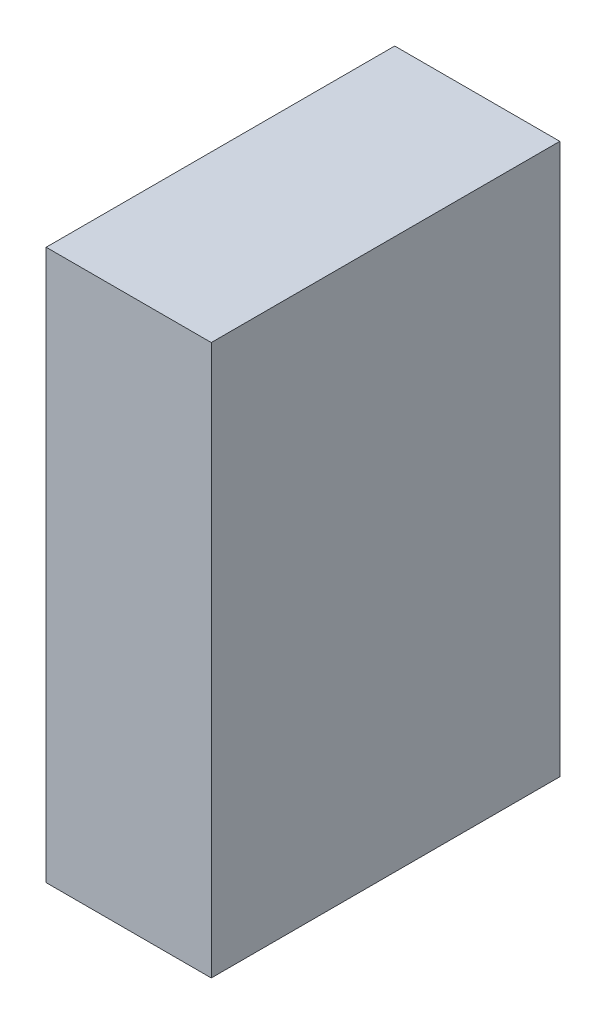
ISO-10303-21;
HEADER;
FILE_DESCRIPTION(('STEP AP214'),'2;1');
FILE_NAME('part.step','',(''),(''),'','','');
FILE_SCHEMA(('AUTOMOTIVE_DESIGN { 1 0 10303 214 1 1 1 1 }'));
ENDSEC;
DATA;
#1=APPLICATION_CONTEXT('core data for automotive mechanical design processes');
#2=APPLICATION_PROTOCOL_DEFINITION('international standard','automotive_design',2000,#1);
#3=PRODUCT_CONTEXT('',#1,'mechanical');
#4=PRODUCT('Part','Part','',(#3));
#5=PRODUCT_RELATED_PRODUCT_CATEGORY('part','',(#4));
#6=PRODUCT_DEFINITION_FORMATION('','',#4);
#7=PRODUCT_DEFINITION_CONTEXT('part definition',#1,'design');
#8=PRODUCT_DEFINITION('design','',#6,#7);
#9=PRODUCT_DEFINITION_SHAPE('','',#8);
#10=(LENGTH_UNIT() NAMED_UNIT(*) SI_UNIT(.MILLI.,.METRE.));
#11=(NAMED_UNIT(*) PLANE_ANGLE_UNIT() SI_UNIT($,.RADIAN.));
#12=(NAMED_UNIT(*) SI_UNIT($,.STERADIAN.) SOLID_ANGLE_UNIT());
#13=UNCERTAINTY_MEASURE_WITH_UNIT(LENGTH_MEASURE(1.E-05),#10,'distance_accuracy_value','');
#14=(GEOMETRIC_REPRESENTATION_CONTEXT(3) GLOBAL_UNCERTAINTY_ASSIGNED_CONTEXT((#13)) GLOBAL_UNIT_ASSIGNED_CONTEXT((#10,
#11,#12)) REPRESENTATION_CONTEXT('',''));
#15=CARTESIAN_POINT('',(0.,0.,0.));
#16=DIRECTION('',(0.,0.,1.));
#17=DIRECTION('',(1.,0.,0.));
#18=AXIS2_PLACEMENT_3D('',#15,#16,#17);
#19=CARTESIAN_POINT('',(-0.1143,0.381,0.));
#20=DIRECTION('',(1.,0.,0.));
#21=DIRECTION('',(0.,0.,-1.));
#22=AXIS2_PLACEMENT_3D('',#19,#20,#21);
#23=PLANE('',#22);
#24=DIRECTION('',(0.,0.,1.));
#25=VECTOR('',#24,1.);
#26=CARTESIAN_POINT('',(-0.1143,-0.381,0.));
#27=LINE('',#26,#25);
#28=CARTESIAN_POINT('',(-0.1143,-0.381,0.));
#29=VERTEX_POINT('',#28);
#30=CARTESIAN_POINT('',(-0.1143,-0.381,0.4826));
#31=VERTEX_POINT('',#30);
#32=EDGE_CURVE('E20',#29,#31,#27,.T.);
#33=ORIENTED_EDGE('',*,*,#32,.T.);
#34=DIRECTION('',(0.,1.,0.));
#35=VECTOR('',#34,1.);
#36=CARTESIAN_POINT('',(-0.1143,-0.381,0.4826));
#37=LINE('',#36,#35);
#38=CARTESIAN_POINT('',(-0.1143,0.381,0.4826));
#39=VERTEX_POINT('',#38);
#40=EDGE_CURVE('E55',#31,#39,#37,.T.);
#41=ORIENTED_EDGE('',*,*,#40,.T.);
#42=DIRECTION('',(0.,0.,-1.));
#43=VECTOR('',#42,1.);
#44=CARTESIAN_POINT('',(-0.1143,0.381,0.));
#45=LINE('',#44,#43);
#46=CARTESIAN_POINT('',(-0.1143,0.381,0.));
#47=VERTEX_POINT('',#46);
#48=EDGE_CURVE('E74',#39,#47,#45,.T.);
#49=ORIENTED_EDGE('',*,*,#48,.T.);
#50=DIRECTION('',(0.,1.,0.));
#51=VECTOR('',#50,1.);
#52=CARTESIAN_POINT('',(-0.1143,-0.381,0.));
#53=LINE('',#52,#51);
#54=EDGE_CURVE('E66',#29,#47,#53,.T.);
#55=ORIENTED_EDGE('',*,*,#54,.F.);
#56=EDGE_LOOP('',(#33,#41,#49,#55));
#57=FACE_BOUND('',#56,.T.);
#58=ADVANCED_FACE('F17',(#57),#23,.F.);
#59=CARTESIAN_POINT('',(-0.1143,-0.381,0.));
#60=DIRECTION('',(0.,1.,0.));
#61=DIRECTION('',(0.,0.,1.));
#62=AXIS2_PLACEMENT_3D('',#59,#60,#61);
#63=PLANE('',#62);
#64=DIRECTION('',(0.,0.,1.));
#65=VECTOR('',#64,1.);
#66=CARTESIAN_POINT('',(0.1143,-0.381,0.));
#67=LINE('',#66,#65);
#68=CARTESIAN_POINT('',(0.1143,-0.381,0.));
#69=VERTEX_POINT('',#68);
#70=CARTESIAN_POINT('',(0.1143,-0.381,0.4826));
#71=VERTEX_POINT('',#70);
#72=EDGE_CURVE('E72',#69,#71,#67,.T.);
#73=ORIENTED_EDGE('',*,*,#72,.T.);
#74=DIRECTION('',(-1.,0.,0.));
#75=VECTOR('',#74,1.);
#76=CARTESIAN_POINT('',(-0.1143,-0.381,0.4826));
#77=LINE('',#76,#75);
#78=EDGE_CURVE('E62',#71,#31,#77,.T.);
#79=ORIENTED_EDGE('',*,*,#78,.T.);
#80=ORIENTED_EDGE('',*,*,#32,.F.);
#81=DIRECTION('',(-1.,0.,0.));
#82=VECTOR('',#81,1.);
#83=CARTESIAN_POINT('',(-0.1143,-0.381,0.));
#84=LINE('',#83,#82);
#85=EDGE_CURVE('E80',#69,#29,#84,.T.);
#86=ORIENTED_EDGE('',*,*,#85,.F.);
#87=EDGE_LOOP('',(#73,#79,#80,#86));
#88=FACE_BOUND('',#87,.T.);
#89=ADVANCED_FACE('F71',(#88),#63,.F.);
#90=CARTESIAN_POINT('',(-0.1143,-0.381,0.4826));
#91=DIRECTION('',(0.,0.,-1.));
#92=DIRECTION('',(-1.,0.,0.));
#93=AXIS2_PLACEMENT_3D('',#90,#91,#92);
#94=PLANE('',#93);
#95=DIRECTION('',(0.,1.,0.));
#96=VECTOR('',#95,1.);
#97=CARTESIAN_POINT('',(0.1143,-0.381,0.4826));
#98=LINE('',#97,#96);
#99=CARTESIAN_POINT('',(0.1143,0.381,0.4826));
#100=VERTEX_POINT('',#99);
#101=EDGE_CURVE('E83',#71,#100,#98,.T.);
#102=ORIENTED_EDGE('',*,*,#101,.T.);
#103=DIRECTION('',(1.,0.,0.));
#104=VECTOR('',#103,1.);
#105=CARTESIAN_POINT('',(0.1143,0.381,0.4826));
#106=LINE('',#105,#104);
#107=EDGE_CURVE('E64',#100,#39,#106,.F.);
#108=ORIENTED_EDGE('',*,*,#107,.T.);
#109=ORIENTED_EDGE('',*,*,#40,.F.);
#110=ORIENTED_EDGE('',*,*,#78,.F.);
#111=EDGE_LOOP('',(#102,#108,#109,#110));
#112=FACE_BOUND('',#111,.T.);
#113=ADVANCED_FACE('F60',(#112),#94,.F.);
#114=CARTESIAN_POINT('',(0.1143,0.381,0.));
#115=DIRECTION('',(0.,-1.,0.));
#116=DIRECTION('',(0.,0.,-1.));
#117=AXIS2_PLACEMENT_3D('',#114,#115,#116);
#118=PLANE('',#117);
#119=ORIENTED_EDGE('',*,*,#48,.F.);
#120=ORIENTED_EDGE('',*,*,#107,.F.);
#121=DIRECTION('',(0.,0.,1.));
#122=VECTOR('',#121,1.);
#123=CARTESIAN_POINT('',(0.1143,0.381,0.));
#124=LINE('',#123,#122);
#125=CARTESIAN_POINT('',(0.1143,0.381,0.));
#126=VERTEX_POINT('',#125);
#127=EDGE_CURVE('E26',#100,#126,#124,.F.);
#128=ORIENTED_EDGE('',*,*,#127,.T.);
#129=DIRECTION('',(-1.,0.,0.));
#130=VECTOR('',#129,1.);
#131=CARTESIAN_POINT('',(-0.1143,0.381,0.));
#132=LINE('',#131,#130);
#133=EDGE_CURVE('E34',#47,#126,#132,.F.);
#134=ORIENTED_EDGE('',*,*,#133,.F.);
#135=EDGE_LOOP('',(#119,#120,#128,#134));
#136=FACE_BOUND('',#135,.T.);
#137=ADVANCED_FACE('F88',(#136),#118,.F.);
#138=CARTESIAN_POINT('',(-0.1143,-0.381,0.));
#139=DIRECTION('',(0.,0.,-1.));
#140=DIRECTION('',(-1.,0.,0.));
#141=AXIS2_PLACEMENT_3D('',#138,#139,#140);
#142=PLANE('',#141);
#143=DIRECTION('',(0.,1.,0.));
#144=VECTOR('',#143,1.);
#145=CARTESIAN_POINT('',(0.1143,-0.381,0.));
#146=LINE('',#145,#144);
#147=EDGE_CURVE('E11',#126,#69,#146,.F.);
#148=ORIENTED_EDGE('',*,*,#147,.T.);
#149=ORIENTED_EDGE('',*,*,#85,.T.);
#150=ORIENTED_EDGE('',*,*,#54,.T.);
#151=ORIENTED_EDGE('',*,*,#133,.T.);
#152=EDGE_LOOP('',(#148,#149,#150,#151));
#153=FACE_BOUND('',#152,.T.);
#154=ADVANCED_FACE('F91',(#153),#142,.T.);
#155=CARTESIAN_POINT('',(0.1143,-0.381,0.));
#156=DIRECTION('',(-1.,0.,0.));
#157=DIRECTION('',(0.,0.,1.));
#158=AXIS2_PLACEMENT_3D('',#155,#156,#157);
#159=PLANE('',#158);
#160=ORIENTED_EDGE('',*,*,#127,.F.);
#161=ORIENTED_EDGE('',*,*,#101,.F.);
#162=ORIENTED_EDGE('',*,*,#72,.F.);
#163=ORIENTED_EDGE('',*,*,#147,.F.);
#164=EDGE_LOOP('',(#160,#161,#162,#163));
#165=FACE_BOUND('',#164,.T.);
#166=ADVANCED_FACE('F90',(#165),#159,.F.);
#167=CLOSED_SHELL('',(#58,#89,#113,#137,#154,#166));
#168=MANIFOLD_SOLID_BREP('B1',#167);
#169=ADVANCED_BREP_SHAPE_REPRESENTATION('',(#18,#168),#14);
#170=SHAPE_DEFINITION_REPRESENTATION(#9,#169);
ENDSEC;
END-ISO-10303-21;
